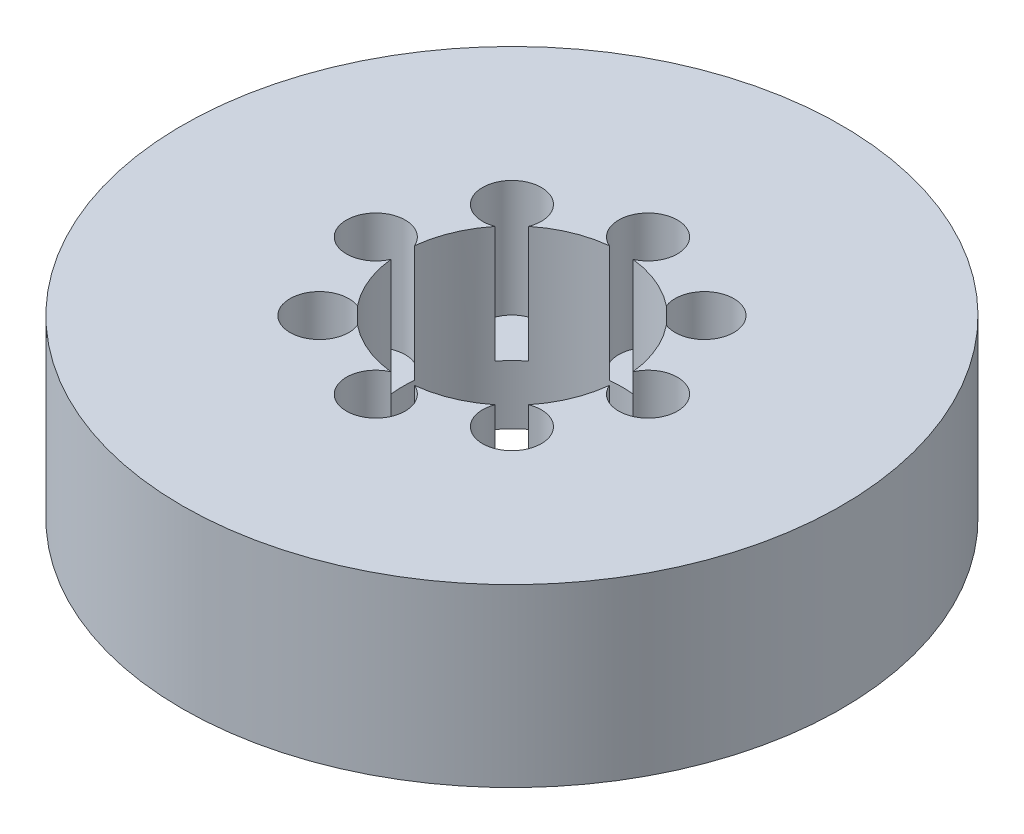
ISO-10303-21;
HEADER;
FILE_DESCRIPTION(('STEP AP214'),'2;1');
FILE_NAME('part.step','',(''),(''),'','','');
FILE_SCHEMA(('AUTOMOTIVE_DESIGN { 1 0 10303 214 1 1 1 1 }'));
ENDSEC;
DATA;
#1=APPLICATION_CONTEXT('core data for automotive mechanical design processes');
#2=APPLICATION_PROTOCOL_DEFINITION('international standard','automotive_design',2000,#1);
#3=PRODUCT_CONTEXT('',#1,'mechanical');
#4=PRODUCT('Part','Part','',(#3));
#5=PRODUCT_RELATED_PRODUCT_CATEGORY('part','',(#4));
#6=PRODUCT_DEFINITION_FORMATION('','',#4);
#7=PRODUCT_DEFINITION_CONTEXT('part definition',#1,'design');
#8=PRODUCT_DEFINITION('design','',#6,#7);
#9=PRODUCT_DEFINITION_SHAPE('','',#8);
#10=(LENGTH_UNIT() NAMED_UNIT(*) SI_UNIT(.MILLI.,.METRE.));
#11=(NAMED_UNIT(*) PLANE_ANGLE_UNIT() SI_UNIT($,.RADIAN.));
#12=(NAMED_UNIT(*) SI_UNIT($,.STERADIAN.) SOLID_ANGLE_UNIT());
#13=UNCERTAINTY_MEASURE_WITH_UNIT(LENGTH_MEASURE(1.E-05),#10,'distance_accuracy_value','');
#14=(GEOMETRIC_REPRESENTATION_CONTEXT(3) GLOBAL_UNCERTAINTY_ASSIGNED_CONTEXT((#13)) GLOBAL_UNIT_ASSIGNED_CONTEXT((#10,
#11,#12)) REPRESENTATION_CONTEXT('',''));
#15=CARTESIAN_POINT('',(0.,0.,0.));
#16=DIRECTION('',(0.,0.,1.));
#17=DIRECTION('',(1.,0.,0.));
#18=AXIS2_PLACEMENT_3D('',#15,#16,#17);
#19=CARTESIAN_POINT('',(0.,28.,0.));
#20=DIRECTION('',(0.,-1.,0.));
#21=DIRECTION('',(0.,0.,-1.));
#22=AXIS2_PLACEMENT_3D('',#19,#20,#21);
#23=CYLINDRICAL_SURFACE('',#22,52.5);
#24=CARTESIAN_POINT('',(0.,28.,0.));
#25=DIRECTION('',(0.,1.,0.));
#26=DIRECTION('',(0.,0.,1.));
#27=AXIS2_PLACEMENT_3D('',#24,#25,#26);
#28=CIRCLE('',#27,52.5);
#29=CARTESIAN_POINT('',(0.,28.,52.5));
#30=VERTEX_POINT('',#29);
#31=EDGE_CURVE('E195',#30,#30,#28,.T.);
#32=ORIENTED_EDGE('',*,*,#31,.F.);
#33=EDGE_LOOP('',(#32));
#34=FACE_BOUND('',#33,.T.);
#35=CARTESIAN_POINT('',(0.,0.,0.));
#36=DIRECTION('',(0.,1.,0.));
#37=DIRECTION('',(0.,0.,1.));
#38=AXIS2_PLACEMENT_3D('',#35,#36,#37);
#39=CIRCLE('',#38,52.5);
#40=CARTESIAN_POINT('',(0.,0.,52.5));
#41=VERTEX_POINT('',#40);
#42=EDGE_CURVE('E179',#41,#41,#39,.T.);
#43=ORIENTED_EDGE('',*,*,#42,.T.);
#44=EDGE_LOOP('',(#43));
#45=FACE_BOUND('',#44,.T.);
#46=ADVANCED_FACE('F39',(#34,#45),#23,.T.);
#47=CARTESIAN_POINT('',(0.,28.,0.));
#48=DIRECTION('',(0.,1.,0.));
#49=DIRECTION('',(0.,0.,1.));
#50=AXIS2_PLACEMENT_3D('',#47,#48,#49);
#51=PLANE('',#50);
#52=CARTESIAN_POINT('',(0.,28.,21.68453954755));
#53=DIRECTION('',(0.,1.,0.));
#54=DIRECTION('',(1.,0.,0.));
#55=AXIS2_PLACEMENT_3D('',#52,#53,#54);
#56=CIRCLE('',#55,4.68503856130497);
#57=CARTESIAN_POINT('',(-1.88999662885407,28.,17.3976410108647));
#58=VERTEX_POINT('',#57);
#59=CARTESIAN_POINT('',(1.88999662885419,28.,17.3976410108647));
#60=VERTEX_POINT('',#59);
#61=EDGE_CURVE('E176',#58,#60,#56,.T.);
#62=ORIENTED_EDGE('',*,*,#61,.F.);
#63=CARTESIAN_POINT('',(0.,28.,0.));
#64=DIRECTION('',(0.,1.,0.));
#65=DIRECTION('',(0.,0.,1.));
#66=AXIS2_PLACEMENT_3D('',#63,#64,#65);
#67=CIRCLE('',#66,17.5);
#68=CARTESIAN_POINT('',(-10.9655605027491,28.,13.6384193681141));
#69=VERTEX_POINT('',#68);
#70=EDGE_CURVE('E166',#69,#58,#67,.T.);
#71=ORIENTED_EDGE('',*,*,#70,.F.);
#72=CARTESIAN_POINT('',(-15.3332849609804,28.,15.3332849609805));
#73=DIRECTION('',(0.,1.,0.));
#74=DIRECTION('',(0.707106781186549,0.,0.707106781186546));
#75=AXIS2_PLACEMENT_3D('',#72,#73,#74);
#76=CIRCLE('',#75,4.68503856130497);
#77=CARTESIAN_POINT('',(-13.638419368114,28.,10.9655605027491));
#78=VERTEX_POINT('',#77);
#79=EDGE_CURVE('E147',#78,#69,#76,.T.);
#80=ORIENTED_EDGE('',*,*,#79,.F.);
#81=CARTESIAN_POINT('',(-17.3976410108647,28.,1.88999662885413));
#82=VERTEX_POINT('',#81);
#83=EDGE_CURVE('E180',#82,#78,#67,.T.);
#84=ORIENTED_EDGE('',*,*,#83,.F.);
#85=CARTESIAN_POINT('',(-21.68453954755,28.,0.));
#86=DIRECTION('',(0.,1.,0.));
#87=DIRECTION('',(0.,0.,1.));
#88=AXIS2_PLACEMENT_3D('',#85,#86,#87);
#89=CIRCLE('',#88,4.68503856130497);
#90=CARTESIAN_POINT('',(-17.3976410108647,28.,-1.88999662885413));
#91=VERTEX_POINT('',#90);
#92=EDGE_CURVE('E186',#91,#82,#89,.T.);
#93=ORIENTED_EDGE('',*,*,#92,.F.);
#94=CARTESIAN_POINT('',(-13.6384193681142,28.,-10.965560502749));
#95=VERTEX_POINT('',#94);
#96=EDGE_CURVE('E182',#95,#91,#67,.T.);
#97=ORIENTED_EDGE('',*,*,#96,.F.);
#98=CARTESIAN_POINT('',(-15.3332849609806,28.,-15.3332849609803));
#99=DIRECTION('',(0.,1.,0.));
#100=DIRECTION('',(-0.707106781186539,0.,0.707106781186556));
#101=AXIS2_PLACEMENT_3D('',#98,#99,#100);
#102=CIRCLE('',#101,4.68503856130497);
#103=CARTESIAN_POINT('',(-10.9655605027493,28.,-13.6384193681139));
#104=VERTEX_POINT('',#103);
#105=EDGE_CURVE('E446',#104,#95,#102,.T.);
#106=ORIENTED_EDGE('',*,*,#105,.F.);
#107=CARTESIAN_POINT('',(-1.88999662885431,28.,-17.3976410108646));
#108=VERTEX_POINT('',#107);
#109=EDGE_CURVE('E452',#108,#104,#67,.T.);
#110=ORIENTED_EDGE('',*,*,#109,.F.);
#111=CARTESIAN_POINT('',(-2.2713349551503E-13,28.,-21.68453954755));
#112=DIRECTION('',(0.,1.,0.));
#113=DIRECTION('',(-1.,0.,0.));
#114=AXIS2_PLACEMENT_3D('',#111,#112,#113);
#115=CIRCLE('',#114,4.68503856130497);
#116=CARTESIAN_POINT('',(1.88999662885395,28.,-17.3976410108647));
#117=VERTEX_POINT('',#116);
#118=EDGE_CURVE('E477',#117,#108,#115,.T.);
#119=ORIENTED_EDGE('',*,*,#118,.F.);
#120=CARTESIAN_POINT('',(10.965560502749,28.,-13.6384193681142));
#121=VERTEX_POINT('',#120);
#122=EDGE_CURVE('E460',#121,#117,#67,.T.);
#123=ORIENTED_EDGE('',*,*,#122,.F.);
#124=CARTESIAN_POINT('',(15.3332849609803,28.,-15.3332849609806));
#125=DIRECTION('',(0.,1.,0.));
#126=DIRECTION('',(-0.707106781186554,0.,-0.707106781186541));
#127=AXIS2_PLACEMENT_3D('',#124,#125,#126);
#128=CIRCLE('',#127,4.68503856130497);
#129=CARTESIAN_POINT('',(13.638419368114,28.,-10.9655605027492));
#130=VERTEX_POINT('',#129);
#131=EDGE_CURVE('E464',#130,#121,#128,.T.);
#132=ORIENTED_EDGE('',*,*,#131,.F.);
#133=CARTESIAN_POINT('',(17.3976410108647,28.,-1.88999662885413));
#134=VERTEX_POINT('',#133);
#135=EDGE_CURVE('E459',#134,#130,#67,.T.);
#136=ORIENTED_EDGE('',*,*,#135,.F.);
#137=CARTESIAN_POINT('',(21.68453954755,28.,0.));
#138=DIRECTION('',(0.,1.,0.));
#139=DIRECTION('',(0.,0.,-1.));
#140=AXIS2_PLACEMENT_3D('',#137,#138,#139);
#141=CIRCLE('',#140,4.68503856130497);
#142=CARTESIAN_POINT('',(17.3976410108647,28.,1.88999662885413));
#143=VERTEX_POINT('',#142);
#144=EDGE_CURVE('E469',#143,#134,#141,.T.);
#145=ORIENTED_EDGE('',*,*,#144,.F.);
#146=CARTESIAN_POINT('',(13.6384193681141,28.,10.965560502749));
#147=VERTEX_POINT('',#146);
#148=EDGE_CURVE('E181',#147,#143,#67,.T.);
#149=ORIENTED_EDGE('',*,*,#148,.F.);
#150=CARTESIAN_POINT('',(15.3332849609805,28.,15.3332849609804));
#151=DIRECTION('',(0.,1.,0.));
#152=DIRECTION('',(0.707106781186544,0.,-0.707106781186551));
#153=AXIS2_PLACEMENT_3D('',#150,#151,#152);
#154=CIRCLE('',#153,4.68503856130497);
#155=CARTESIAN_POINT('',(10.9655605027492,28.,13.638419368114));
#156=VERTEX_POINT('',#155);
#157=EDGE_CURVE('E475',#156,#147,#154,.T.);
#158=ORIENTED_EDGE('',*,*,#157,.F.);
#159=EDGE_CURVE('E177',#60,#156,#67,.T.);
#160=ORIENTED_EDGE('',*,*,#159,.F.);
#161=EDGE_LOOP('',(#62,#71,#80,#84,#93,#97,#106,#110,#119,#123,#132,#136,#145,#149,#158,#160));
#162=FACE_BOUND('',#161,.T.);
#163=ORIENTED_EDGE('',*,*,#31,.T.);
#164=EDGE_LOOP('',(#163));
#165=FACE_BOUND('',#164,.T.);
#166=ADVANCED_FACE('F172',(#162,#165),#51,.T.);
#167=CARTESIAN_POINT('',(0.,0.,0.));
#168=DIRECTION('',(0.,1.,0.));
#169=DIRECTION('',(0.,0.,1.));
#170=AXIS2_PLACEMENT_3D('',#167,#168,#169);
#171=PLANE('',#170);
#172=CARTESIAN_POINT('',(0.,0.,0.));
#173=DIRECTION('',(0.,1.,0.));
#174=DIRECTION('',(0.,0.,1.));
#175=AXIS2_PLACEMENT_3D('',#172,#173,#174);
#176=CIRCLE('',#175,17.5);
#177=CARTESIAN_POINT('',(0.,0.,17.5));
#178=VERTEX_POINT('',#177);
#179=EDGE_CURVE('E187',#178,#178,#176,.T.);
#180=ORIENTED_EDGE('',*,*,#179,.T.);
#181=EDGE_LOOP('',(#180));
#182=FACE_BOUND('',#181,.T.);
#183=ORIENTED_EDGE('',*,*,#42,.F.);
#184=EDGE_LOOP('',(#183));
#185=FACE_BOUND('',#184,.T.);
#186=ADVANCED_FACE('F270',(#182,#185),#171,.F.);
#187=CARTESIAN_POINT('',(0.,28.,0.));
#188=DIRECTION('',(0.,-1.,0.));
#189=DIRECTION('',(0.,0.,-1.));
#190=AXIS2_PLACEMENT_3D('',#187,#188,#189);
#191=CYLINDRICAL_SURFACE('',#190,17.5);
#192=DIRECTION('',(0.,1.,0.));
#193=VECTOR('',#192,1.);
#194=CARTESIAN_POINT('',(-1.88999662885406,18.7104384381845,17.3976410108647));
#195=LINE('',#194,#193);
#196=CARTESIAN_POINT('',(-1.88999662885407,9.420876876369,17.3976410108647));
#197=VERTEX_POINT('',#196);
#198=EDGE_CURVE('E11',#197,#58,#195,.T.);
#199=ORIENTED_EDGE('',*,*,#198,.F.);
#200=CARTESIAN_POINT('',(0.,9.420876876369,0.));
#201=DIRECTION('',(0.,1.,0.));
#202=DIRECTION('',(0.,0.,1.));
#203=AXIS2_PLACEMENT_3D('',#200,#201,#202);
#204=CIRCLE('',#203,17.5);
#205=CARTESIAN_POINT('',(1.88999662885419,9.420876876369,17.3976410108647));
#206=VERTEX_POINT('',#205);
#207=EDGE_CURVE('E250',#197,#206,#204,.T.);
#208=ORIENTED_EDGE('',*,*,#207,.T.);
#209=DIRECTION('',(0.,1.,0.));
#210=VECTOR('',#209,1.);
#211=CARTESIAN_POINT('',(1.88999662885419,18.7104384381845,17.3976410108647));
#212=LINE('',#211,#210);
#213=EDGE_CURVE('E46',#60,#206,#212,.F.);
#214=ORIENTED_EDGE('',*,*,#213,.F.);
#215=ORIENTED_EDGE('',*,*,#159,.T.);
#216=DIRECTION('',(0.,1.,0.));
#217=VECTOR('',#216,1.);
#218=CARTESIAN_POINT('',(10.9655605027492,18.7104384381845,13.638419368114));
#219=LINE('',#218,#217);
#220=CARTESIAN_POINT('',(10.9655605027492,9.420876876369,13.638419368114));
#221=VERTEX_POINT('',#220);
#222=EDGE_CURVE('E244',#221,#156,#219,.T.);
#223=ORIENTED_EDGE('',*,*,#222,.F.);
#224=CARTESIAN_POINT('',(0.,9.420876876369,0.));
#225=DIRECTION('',(0.,1.,0.));
#226=DIRECTION('',(0.,0.,1.));
#227=AXIS2_PLACEMENT_3D('',#224,#225,#226);
#228=CIRCLE('',#227,17.5);
#229=CARTESIAN_POINT('',(13.6384193681141,9.420876876369,10.965560502749));
#230=VERTEX_POINT('',#229);
#231=EDGE_CURVE('E238',#221,#230,#228,.T.);
#232=ORIENTED_EDGE('',*,*,#231,.T.);
#233=DIRECTION('',(0.,1.,0.));
#234=VECTOR('',#233,1.);
#235=CARTESIAN_POINT('',(13.6384193681141,18.7104384381845,10.965560502749));
#236=LINE('',#235,#234);
#237=EDGE_CURVE('E242',#147,#230,#236,.F.);
#238=ORIENTED_EDGE('',*,*,#237,.F.);
#239=ORIENTED_EDGE('',*,*,#148,.T.);
#240=DIRECTION('',(0.,1.,0.));
#241=VECTOR('',#240,1.);
#242=CARTESIAN_POINT('',(17.3976410108647,18.7104384381845,1.88999662885412));
#243=LINE('',#242,#241);
#244=CARTESIAN_POINT('',(17.3976410108647,9.420876876369,1.88999662885413));
#245=VERTEX_POINT('',#244);
#246=EDGE_CURVE('E236',#245,#143,#243,.T.);
#247=ORIENTED_EDGE('',*,*,#246,.F.);
#248=CARTESIAN_POINT('',(0.,9.420876876369,0.));
#249=DIRECTION('',(0.,1.,0.));
#250=DIRECTION('',(0.,0.,1.));
#251=AXIS2_PLACEMENT_3D('',#248,#249,#250);
#252=CIRCLE('',#251,17.5);
#253=CARTESIAN_POINT('',(17.3976410108647,9.420876876369,-1.88999662885413));
#254=VERTEX_POINT('',#253);
#255=EDGE_CURVE('E235',#245,#254,#252,.T.);
#256=ORIENTED_EDGE('',*,*,#255,.T.);
#257=DIRECTION('',(0.,1.,0.));
#258=VECTOR('',#257,1.);
#259=CARTESIAN_POINT('',(17.3976410108647,18.7104384381845,-1.88999662885412));
#260=LINE('',#259,#258);
#261=EDGE_CURVE('E234',#134,#254,#260,.F.);
#262=ORIENTED_EDGE('',*,*,#261,.F.);
#263=ORIENTED_EDGE('',*,*,#135,.T.);
#264=DIRECTION('',(0.,1.,0.));
#265=VECTOR('',#264,1.);
#266=CARTESIAN_POINT('',(13.638419368114,18.7104384381845,-10.9655605027492));
#267=LINE('',#266,#265);
#268=CARTESIAN_POINT('',(13.638419368114,9.420876876369,-10.9655605027492));
#269=VERTEX_POINT('',#268);
#270=EDGE_CURVE('E229',#269,#130,#267,.T.);
#271=ORIENTED_EDGE('',*,*,#270,.F.);
#272=CARTESIAN_POINT('',(0.,9.420876876369,0.));
#273=DIRECTION('',(0.,1.,0.));
#274=DIRECTION('',(0.,0.,1.));
#275=AXIS2_PLACEMENT_3D('',#272,#273,#274);
#276=CIRCLE('',#275,17.5);
#277=CARTESIAN_POINT('',(10.965560502749,9.420876876369,-13.6384193681142));
#278=VERTEX_POINT('',#277);
#279=EDGE_CURVE('E221',#269,#278,#276,.T.);
#280=ORIENTED_EDGE('',*,*,#279,.T.);
#281=DIRECTION('',(0.,1.,0.));
#282=VECTOR('',#281,1.);
#283=CARTESIAN_POINT('',(10.965560502749,18.7104384381845,-13.6384193681141));
#284=LINE('',#283,#282);
#285=EDGE_CURVE('E230',#121,#278,#284,.F.);
#286=ORIENTED_EDGE('',*,*,#285,.F.);
#287=ORIENTED_EDGE('',*,*,#122,.T.);
#288=DIRECTION('',(0.,1.,0.));
#289=VECTOR('',#288,1.);
#290=CARTESIAN_POINT('',(1.88999662885394,18.7104384381845,-17.3976410108647));
#291=LINE('',#290,#289);
#292=CARTESIAN_POINT('',(1.88999662885395,9.420876876369,-17.3976410108647));
#293=VERTEX_POINT('',#292);
#294=EDGE_CURVE('E225',#293,#117,#291,.T.);
#295=ORIENTED_EDGE('',*,*,#294,.F.);
#296=CARTESIAN_POINT('',(0.,9.420876876369,0.));
#297=DIRECTION('',(0.,1.,0.));
#298=DIRECTION('',(0.,0.,1.));
#299=AXIS2_PLACEMENT_3D('',#296,#297,#298);
#300=CIRCLE('',#299,17.5);
#301=CARTESIAN_POINT('',(-1.88999662885431,9.420876876369,-17.3976410108646));
#302=VERTEX_POINT('',#301);
#303=EDGE_CURVE('E216',#293,#302,#300,.T.);
#304=ORIENTED_EDGE('',*,*,#303,.T.);
#305=DIRECTION('',(0.,1.,0.));
#306=VECTOR('',#305,1.);
#307=CARTESIAN_POINT('',(-1.88999662885431,18.7104384381845,-17.3976410108646));
#308=LINE('',#307,#306);
#309=EDGE_CURVE('E218',#108,#302,#308,.F.);
#310=ORIENTED_EDGE('',*,*,#309,.F.);
#311=ORIENTED_EDGE('',*,*,#109,.T.);
#312=DIRECTION('',(0.,1.,0.));
#313=VECTOR('',#312,1.);
#314=CARTESIAN_POINT('',(-10.9655605027493,18.7104384381845,-13.6384193681139));
#315=LINE('',#314,#313);
#316=CARTESIAN_POINT('',(-10.9655605027493,9.420876876369,-13.6384193681139));
#317=VERTEX_POINT('',#316);
#318=EDGE_CURVE('E212',#317,#104,#315,.T.);
#319=ORIENTED_EDGE('',*,*,#318,.F.);
#320=CARTESIAN_POINT('',(0.,9.420876876369,0.));
#321=DIRECTION('',(0.,1.,0.));
#322=DIRECTION('',(0.,0.,1.));
#323=AXIS2_PLACEMENT_3D('',#320,#321,#322);
#324=CIRCLE('',#323,17.5);
#325=CARTESIAN_POINT('',(-13.6384193681142,9.420876876369,-10.965560502749));
#326=VERTEX_POINT('',#325);
#327=EDGE_CURVE('E208',#317,#326,#324,.T.);
#328=ORIENTED_EDGE('',*,*,#327,.T.);
#329=DIRECTION('',(0.,1.,0.));
#330=VECTOR('',#329,1.);
#331=CARTESIAN_POINT('',(-13.6384193681142,18.7104384381845,-10.965560502749));
#332=LINE('',#331,#330);
#333=EDGE_CURVE('E211',#95,#326,#332,.F.);
#334=ORIENTED_EDGE('',*,*,#333,.F.);
#335=ORIENTED_EDGE('',*,*,#96,.T.);
#336=DIRECTION('',(0.,1.,0.));
#337=VECTOR('',#336,1.);
#338=CARTESIAN_POINT('',(-17.3976410108647,18.7104384381845,-1.88999662885412));
#339=LINE('',#338,#337);
#340=CARTESIAN_POINT('',(-17.3976410108647,9.420876876369,-1.88999662885413));
#341=VERTEX_POINT('',#340);
#342=EDGE_CURVE('E201',#341,#91,#339,.T.);
#343=ORIENTED_EDGE('',*,*,#342,.F.);
#344=CARTESIAN_POINT('',(0.,9.420876876369,0.));
#345=DIRECTION('',(0.,1.,0.));
#346=DIRECTION('',(0.,0.,1.));
#347=AXIS2_PLACEMENT_3D('',#344,#345,#346);
#348=CIRCLE('',#347,17.5);
#349=CARTESIAN_POINT('',(-17.3976410108647,9.420876876369,1.88999662885413));
#350=VERTEX_POINT('',#349);
#351=EDGE_CURVE('E194',#341,#350,#348,.T.);
#352=ORIENTED_EDGE('',*,*,#351,.T.);
#353=DIRECTION('',(0.,1.,0.));
#354=VECTOR('',#353,1.);
#355=CARTESIAN_POINT('',(-17.3976410108647,18.7104384381845,1.88999662885412));
#356=LINE('',#355,#354);
#357=EDGE_CURVE('E199',#82,#350,#356,.F.);
#358=ORIENTED_EDGE('',*,*,#357,.F.);
#359=ORIENTED_EDGE('',*,*,#83,.T.);
#360=DIRECTION('',(0.,1.,0.));
#361=VECTOR('',#360,1.);
#362=CARTESIAN_POINT('',(-13.638419368114,18.7104384381845,10.9655605027491));
#363=LINE('',#362,#361);
#364=CARTESIAN_POINT('',(-13.638419368114,9.420876876369,10.9655605027491));
#365=VERTEX_POINT('',#364);
#366=EDGE_CURVE('E160',#365,#78,#363,.T.);
#367=ORIENTED_EDGE('',*,*,#366,.F.);
#368=CARTESIAN_POINT('',(0.,9.420876876369,0.));
#369=DIRECTION('',(0.,1.,0.));
#370=DIRECTION('',(0.,0.,1.));
#371=AXIS2_PLACEMENT_3D('',#368,#369,#370);
#372=CIRCLE('',#371,17.5);
#373=CARTESIAN_POINT('',(-10.9655605027491,9.420876876369,13.6384193681141));
#374=VERTEX_POINT('',#373);
#375=EDGE_CURVE('E168',#365,#374,#372,.T.);
#376=ORIENTED_EDGE('',*,*,#375,.T.);
#377=DIRECTION('',(0.,1.,0.));
#378=VECTOR('',#377,1.);
#379=CARTESIAN_POINT('',(-10.9655605027491,18.7104384381845,13.6384193681141));
#380=LINE('',#379,#378);
#381=EDGE_CURVE('E152',#69,#374,#380,.F.);
#382=ORIENTED_EDGE('',*,*,#381,.F.);
#383=ORIENTED_EDGE('',*,*,#70,.T.);
#384=EDGE_LOOP('',(#199,#208,#214,#215,#223,#232,#238,#239,#247,#256,#262,#263,#271,#280,#286,
#287,#295,#304,#310,#311,#319,#328,#334,#335,#343,#352,#358,#359,#367,#376,#382,#383));
#385=FACE_BOUND('',#384,.T.);
#386=ORIENTED_EDGE('',*,*,#179,.F.);
#387=EDGE_LOOP('',(#386));
#388=FACE_BOUND('',#387,.T.);
#389=ADVANCED_FACE('F170',(#385,#388),#191,.F.);
#390=CARTESIAN_POINT('',(-21.68453954755,9.420876876369,0.));
#391=DIRECTION('',(0.,1.,0.));
#392=DIRECTION('',(0.,0.,1.));
#393=AXIS2_PLACEMENT_3D('',#390,#391,#392);
#394=CYLINDRICAL_SURFACE('',#393,4.68503856130497);
#395=ORIENTED_EDGE('',*,*,#342,.T.);
#396=ORIENTED_EDGE('',*,*,#92,.T.);
#397=ORIENTED_EDGE('',*,*,#357,.T.);
#398=CARTESIAN_POINT('',(-21.68453954755,9.420876876369,0.));
#399=DIRECTION('',(0.,1.,0.));
#400=DIRECTION('',(0.,0.,1.));
#401=AXIS2_PLACEMENT_3D('',#398,#399,#400);
#402=CIRCLE('',#401,4.68503856130497);
#403=EDGE_CURVE('E191',#341,#350,#402,.T.);
#404=ORIENTED_EDGE('',*,*,#403,.F.);
#405=EDGE_LOOP('',(#395,#396,#397,#404));
#406=FACE_BOUND('',#405,.T.);
#407=ADVANCED_FACE('F279',(#406),#394,.F.);
#408=CARTESIAN_POINT('',(-21.68453954755,9.420876876369,0.));
#409=DIRECTION('',(0.,1.,0.));
#410=DIRECTION('',(0.,0.,1.));
#411=AXIS2_PLACEMENT_3D('',#408,#409,#410);
#412=PLANE('',#411);
#413=ORIENTED_EDGE('',*,*,#403,.T.);
#414=ORIENTED_EDGE('',*,*,#351,.F.);
#415=EDGE_LOOP('',(#413,#414));
#416=FACE_BOUND('',#415,.T.);
#417=ADVANCED_FACE('F285',(#416),#412,.T.);
#418=CARTESIAN_POINT('',(-15.3332849609804,9.420876876369,15.3332849609805));
#419=DIRECTION('',(0.,1.,0.));
#420=DIRECTION('',(0.,0.,1.));
#421=AXIS2_PLACEMENT_3D('',#418,#419,#420);
#422=CYLINDRICAL_SURFACE('',#421,4.68503856130497);
#423=ORIENTED_EDGE('',*,*,#366,.T.);
#424=ORIENTED_EDGE('',*,*,#79,.T.);
#425=ORIENTED_EDGE('',*,*,#381,.T.);
#426=CARTESIAN_POINT('',(-15.3332849609804,9.420876876369,15.3332849609805));
#427=DIRECTION('',(0.,1.,0.));
#428=DIRECTION('',(0.707106781186549,0.,0.707106781186546));
#429=AXIS2_PLACEMENT_3D('',#426,#427,#428);
#430=CIRCLE('',#429,4.68503856130497);
#431=EDGE_CURVE('E165',#365,#374,#430,.T.);
#432=ORIENTED_EDGE('',*,*,#431,.F.);
#433=EDGE_LOOP('',(#423,#424,#425,#432));
#434=FACE_BOUND('',#433,.T.);
#435=ADVANCED_FACE('F155',(#434),#422,.F.);
#436=CARTESIAN_POINT('',(-15.3332849609804,9.420876876369,15.3332849609805));
#437=DIRECTION('',(0.,1.,0.));
#438=DIRECTION('',(0.707106781186549,0.,0.707106781186546));
#439=AXIS2_PLACEMENT_3D('',#436,#437,#438);
#440=PLANE('',#439);
#441=ORIENTED_EDGE('',*,*,#431,.T.);
#442=ORIENTED_EDGE('',*,*,#375,.F.);
#443=EDGE_LOOP('',(#441,#442));
#444=FACE_BOUND('',#443,.T.);
#445=ADVANCED_FACE('F288',(#444),#440,.T.);
#446=CARTESIAN_POINT('',(-15.3332849609806,9.420876876369,-15.3332849609803));
#447=DIRECTION('',(0.,1.,0.));
#448=DIRECTION('',(0.,0.,1.));
#449=AXIS2_PLACEMENT_3D('',#446,#447,#448);
#450=CYLINDRICAL_SURFACE('',#449,4.68503856130497);
#451=ORIENTED_EDGE('',*,*,#318,.T.);
#452=ORIENTED_EDGE('',*,*,#105,.T.);
#453=ORIENTED_EDGE('',*,*,#333,.T.);
#454=CARTESIAN_POINT('',(-15.3332849609806,9.420876876369,-15.3332849609803));
#455=DIRECTION('',(0.,1.,0.));
#456=DIRECTION('',(-0.707106781186539,0.,0.707106781186556));
#457=AXIS2_PLACEMENT_3D('',#454,#455,#456);
#458=CIRCLE('',#457,4.68503856130497);
#459=EDGE_CURVE('E447',#317,#326,#458,.T.);
#460=ORIENTED_EDGE('',*,*,#459,.F.);
#461=EDGE_LOOP('',(#451,#452,#453,#460));
#462=FACE_BOUND('',#461,.T.);
#463=ADVANCED_FACE('F295',(#462),#450,.F.);
#464=CARTESIAN_POINT('',(-15.3332849609806,9.420876876369,-15.3332849609803));
#465=DIRECTION('',(0.,1.,0.));
#466=DIRECTION('',(-0.707106781186539,0.,0.707106781186556));
#467=AXIS2_PLACEMENT_3D('',#464,#465,#466);
#468=PLANE('',#467);
#469=ORIENTED_EDGE('',*,*,#459,.T.);
#470=ORIENTED_EDGE('',*,*,#327,.F.);
#471=EDGE_LOOP('',(#469,#470));
#472=FACE_BOUND('',#471,.T.);
#473=ADVANCED_FACE('F375',(#472),#468,.T.);
#474=CARTESIAN_POINT('',(-2.2713349551503E-13,9.420876876369,-21.68453954755));
#475=DIRECTION('',(0.,1.,0.));
#476=DIRECTION('',(0.,0.,1.));
#477=AXIS2_PLACEMENT_3D('',#474,#475,#476);
#478=CYLINDRICAL_SURFACE('',#477,4.68503856130497);
#479=ORIENTED_EDGE('',*,*,#294,.T.);
#480=ORIENTED_EDGE('',*,*,#118,.T.);
#481=ORIENTED_EDGE('',*,*,#309,.T.);
#482=CARTESIAN_POINT('',(-2.2713349551503E-13,9.420876876369,-21.68453954755));
#483=DIRECTION('',(0.,1.,0.));
#484=DIRECTION('',(-1.,0.,0.));
#485=AXIS2_PLACEMENT_3D('',#482,#483,#484);
#486=CIRCLE('',#485,4.68503856130497);
#487=EDGE_CURVE('E467',#293,#302,#486,.T.);
#488=ORIENTED_EDGE('',*,*,#487,.F.);
#489=EDGE_LOOP('',(#479,#480,#481,#488));
#490=FACE_BOUND('',#489,.T.);
#491=ADVANCED_FACE('F361',(#490),#478,.F.);
#492=CARTESIAN_POINT('',(-2.2713349551503E-13,9.420876876369,-21.68453954755));
#493=DIRECTION('',(0.,1.,0.));
#494=DIRECTION('',(-1.,0.,0.));
#495=AXIS2_PLACEMENT_3D('',#492,#493,#494);
#496=PLANE('',#495);
#497=ORIENTED_EDGE('',*,*,#487,.T.);
#498=ORIENTED_EDGE('',*,*,#303,.F.);
#499=EDGE_LOOP('',(#497,#498));
#500=FACE_BOUND('',#499,.T.);
#501=ADVANCED_FACE('F297',(#500),#496,.T.);
#502=CARTESIAN_POINT('',(15.3332849609803,9.420876876369,-15.3332849609806));
#503=DIRECTION('',(0.,1.,0.));
#504=DIRECTION('',(0.,0.,1.));
#505=AXIS2_PLACEMENT_3D('',#502,#503,#504);
#506=CYLINDRICAL_SURFACE('',#505,4.68503856130497);
#507=ORIENTED_EDGE('',*,*,#270,.T.);
#508=ORIENTED_EDGE('',*,*,#131,.T.);
#509=ORIENTED_EDGE('',*,*,#285,.T.);
#510=CARTESIAN_POINT('',(15.3332849609803,9.420876876369,-15.3332849609806));
#511=DIRECTION('',(0.,1.,0.));
#512=DIRECTION('',(-0.707106781186554,0.,-0.707106781186541));
#513=AXIS2_PLACEMENT_3D('',#510,#511,#512);
#514=CIRCLE('',#513,4.68503856130497);
#515=EDGE_CURVE('E470',#269,#278,#514,.T.);
#516=ORIENTED_EDGE('',*,*,#515,.F.);
#517=EDGE_LOOP('',(#507,#508,#509,#516));
#518=FACE_BOUND('',#517,.T.);
#519=ADVANCED_FACE('F294',(#518),#506,.F.);
#520=CARTESIAN_POINT('',(15.3332849609803,9.420876876369,-15.3332849609806));
#521=DIRECTION('',(0.,1.,0.));
#522=DIRECTION('',(-0.707106781186554,0.,-0.707106781186541));
#523=AXIS2_PLACEMENT_3D('',#520,#521,#522);
#524=PLANE('',#523);
#525=ORIENTED_EDGE('',*,*,#515,.T.);
#526=ORIENTED_EDGE('',*,*,#279,.F.);
#527=EDGE_LOOP('',(#525,#526));
#528=FACE_BOUND('',#527,.T.);
#529=ADVANCED_FACE('F300',(#528),#524,.T.);
#530=CARTESIAN_POINT('',(21.68453954755,9.420876876369,0.));
#531=DIRECTION('',(0.,1.,0.));
#532=DIRECTION('',(0.,0.,1.));
#533=AXIS2_PLACEMENT_3D('',#530,#531,#532);
#534=CYLINDRICAL_SURFACE('',#533,4.68503856130497);
#535=ORIENTED_EDGE('',*,*,#246,.T.);
#536=ORIENTED_EDGE('',*,*,#144,.T.);
#537=ORIENTED_EDGE('',*,*,#261,.T.);
#538=CARTESIAN_POINT('',(21.68453954755,9.420876876369,0.));
#539=DIRECTION('',(0.,1.,0.));
#540=DIRECTION('',(0.,0.,-1.));
#541=AXIS2_PLACEMENT_3D('',#538,#539,#540);
#542=CIRCLE('',#541,4.68503856130497);
#543=EDGE_CURVE('E472',#245,#254,#542,.T.);
#544=ORIENTED_EDGE('',*,*,#543,.F.);
#545=EDGE_LOOP('',(#535,#536,#537,#544));
#546=FACE_BOUND('',#545,.T.);
#547=ADVANCED_FACE('F305',(#546),#534,.F.);
#548=CARTESIAN_POINT('',(21.68453954755,9.420876876369,0.));
#549=DIRECTION('',(0.,1.,0.));
#550=DIRECTION('',(0.,0.,-1.));
#551=AXIS2_PLACEMENT_3D('',#548,#549,#550);
#552=PLANE('',#551);
#553=ORIENTED_EDGE('',*,*,#543,.T.);
#554=ORIENTED_EDGE('',*,*,#255,.F.);
#555=EDGE_LOOP('',(#553,#554));
#556=FACE_BOUND('',#555,.T.);
#557=ADVANCED_FACE('F308',(#556),#552,.T.);
#558=CARTESIAN_POINT('',(15.3332849609805,9.420876876369,15.3332849609804));
#559=DIRECTION('',(0.,1.,0.));
#560=DIRECTION('',(0.,0.,1.));
#561=AXIS2_PLACEMENT_3D('',#558,#559,#560);
#562=CYLINDRICAL_SURFACE('',#561,4.68503856130497);
#563=ORIENTED_EDGE('',*,*,#222,.T.);
#564=ORIENTED_EDGE('',*,*,#157,.T.);
#565=ORIENTED_EDGE('',*,*,#237,.T.);
#566=CARTESIAN_POINT('',(15.3332849609805,9.420876876369,15.3332849609804));
#567=DIRECTION('',(0.,1.,0.));
#568=DIRECTION('',(0.707106781186544,0.,-0.707106781186551));
#569=AXIS2_PLACEMENT_3D('',#566,#567,#568);
#570=CIRCLE('',#569,4.68503856130497);
#571=EDGE_CURVE('E56',#221,#230,#570,.T.);
#572=ORIENTED_EDGE('',*,*,#571,.F.);
#573=EDGE_LOOP('',(#563,#564,#565,#572));
#574=FACE_BOUND('',#573,.T.);
#575=ADVANCED_FACE('F309',(#574),#562,.F.);
#576=CARTESIAN_POINT('',(15.3332849609805,9.420876876369,15.3332849609804));
#577=DIRECTION('',(0.,1.,0.));
#578=DIRECTION('',(0.707106781186544,0.,-0.707106781186551));
#579=AXIS2_PLACEMENT_3D('',#576,#577,#578);
#580=PLANE('',#579);
#581=ORIENTED_EDGE('',*,*,#571,.T.);
#582=ORIENTED_EDGE('',*,*,#231,.F.);
#583=EDGE_LOOP('',(#581,#582));
#584=FACE_BOUND('',#583,.T.);
#585=ADVANCED_FACE('F256',(#584),#580,.T.);
#586=CARTESIAN_POINT('',(0.,9.420876876369,21.68453954755));
#587=DIRECTION('',(0.,1.,0.));
#588=DIRECTION('',(0.,0.,1.));
#589=AXIS2_PLACEMENT_3D('',#586,#587,#588);
#590=CYLINDRICAL_SURFACE('',#589,4.68503856130497);
#591=ORIENTED_EDGE('',*,*,#198,.T.);
#592=ORIENTED_EDGE('',*,*,#61,.T.);
#593=ORIENTED_EDGE('',*,*,#213,.T.);
#594=CARTESIAN_POINT('',(0.,9.420876876369,21.68453954755));
#595=DIRECTION('',(0.,1.,0.));
#596=DIRECTION('',(1.,0.,0.));
#597=AXIS2_PLACEMENT_3D('',#594,#595,#596);
#598=CIRCLE('',#597,4.68503856130497);
#599=EDGE_CURVE('E55',#197,#206,#598,.T.);
#600=ORIENTED_EDGE('',*,*,#599,.F.);
#601=EDGE_LOOP('',(#591,#592,#593,#600));
#602=FACE_BOUND('',#601,.T.);
#603=ADVANCED_FACE('F253',(#602),#590,.F.);
#604=CARTESIAN_POINT('',(0.,9.420876876369,21.68453954755));
#605=DIRECTION('',(0.,1.,0.));
#606=DIRECTION('',(1.,0.,0.));
#607=AXIS2_PLACEMENT_3D('',#604,#605,#606);
#608=PLANE('',#607);
#609=ORIENTED_EDGE('',*,*,#599,.T.);
#610=ORIENTED_EDGE('',*,*,#207,.F.);
#611=EDGE_LOOP('',(#609,#610));
#612=FACE_BOUND('',#611,.T.);
#613=ADVANCED_FACE('F252',(#612),#608,.T.);
#614=CLOSED_SHELL('',(#46,#166,#186,#389,#407,#417,#435,#445,#463,#473,#491,#501,#519,#529,#547,
#557,#575,#585,#603,#613));
#615=MANIFOLD_SOLID_BREP('B2',#614);
#616=ADVANCED_BREP_SHAPE_REPRESENTATION('',(#18,#615),#14);
#617=SHAPE_DEFINITION_REPRESENTATION(#9,#616);
ENDSEC;
END-ISO-10303-21;
